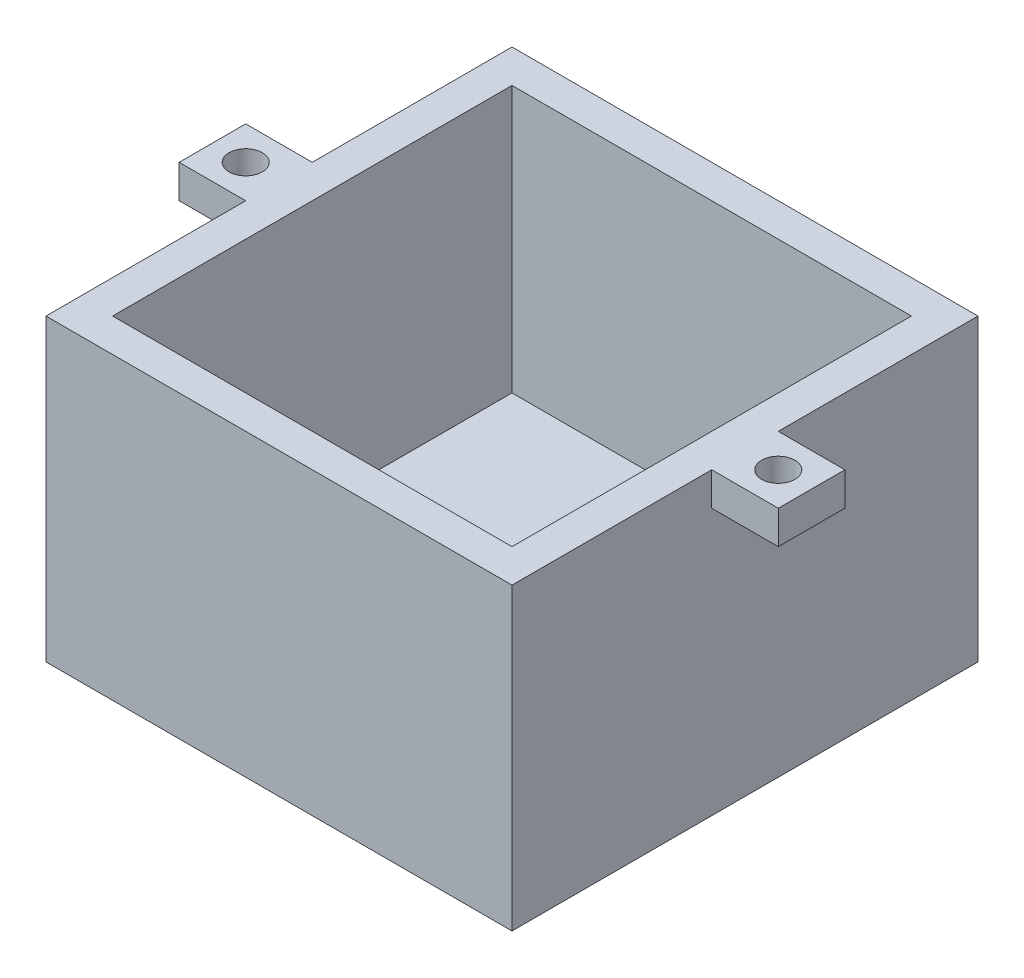
ISO-10303-21;
HEADER;
FILE_DESCRIPTION(('STEP AP214'),'2;1');
FILE_NAME('part.step','',(''),(''),'','','');
FILE_SCHEMA(('AUTOMOTIVE_DESIGN { 1 0 10303 214 1 1 1 1 }'));
ENDSEC;
DATA;
#1=APPLICATION_CONTEXT('core data for automotive mechanical design processes');
#2=APPLICATION_PROTOCOL_DEFINITION('international standard','automotive_design',2000,#1);
#3=PRODUCT_CONTEXT('',#1,'mechanical');
#4=PRODUCT('Part','Part','',(#3));
#5=PRODUCT_RELATED_PRODUCT_CATEGORY('part','',(#4));
#6=PRODUCT_DEFINITION_FORMATION('','',#4);
#7=PRODUCT_DEFINITION_CONTEXT('part definition',#1,'design');
#8=PRODUCT_DEFINITION('design','',#6,#7);
#9=PRODUCT_DEFINITION_SHAPE('','',#8);
#10=(LENGTH_UNIT() NAMED_UNIT(*) SI_UNIT(.MILLI.,.METRE.));
#11=(NAMED_UNIT(*) PLANE_ANGLE_UNIT() SI_UNIT($,.RADIAN.));
#12=(NAMED_UNIT(*) SI_UNIT($,.STERADIAN.) SOLID_ANGLE_UNIT());
#13=UNCERTAINTY_MEASURE_WITH_UNIT(LENGTH_MEASURE(1.E-05),#10,'distance_accuracy_value','');
#14=(GEOMETRIC_REPRESENTATION_CONTEXT(3) GLOBAL_UNCERTAINTY_ASSIGNED_CONTEXT((#13)) GLOBAL_UNIT_ASSIGNED_CONTEXT((#10,
#11,#12)) REPRESENTATION_CONTEXT('',''));
#15=CARTESIAN_POINT('',(0.,0.,0.));
#16=DIRECTION('',(0.,0.,1.));
#17=DIRECTION('',(1.,0.,0.));
#18=AXIS2_PLACEMENT_3D('',#15,#16,#17);
#19=CARTESIAN_POINT('',(-6.35,50.8,6.35));
#20=DIRECTION('',(1.,0.,0.));
#21=DIRECTION('',(0.,0.,-1.));
#22=AXIS2_PLACEMENT_3D('',#19,#20,#21);
#23=PLANE('',#22);
#24=DIRECTION('',(0.,1.,0.));
#25=VECTOR('',#24,1.);
#26=CARTESIAN_POINT('',(-6.35000000000001,44.45,-31.75));
#27=LINE('',#26,#25);
#28=CARTESIAN_POINT('',(-6.35000000000001,44.45,-31.75));
#29=VERTEX_POINT('',#28);
#30=CARTESIAN_POINT('',(-6.35000000000001,50.8,-31.75));
#31=VERTEX_POINT('',#30);
#32=EDGE_CURVE('E181',#29,#31,#27,.T.);
#33=ORIENTED_EDGE('',*,*,#32,.F.);
#34=DIRECTION('',(0.,0.,-1.));
#35=VECTOR('',#34,1.);
#36=CARTESIAN_POINT('',(-6.35000000000001,44.45,-44.45));
#37=LINE('',#36,#35);
#38=CARTESIAN_POINT('',(-6.35000000000001,44.45,-44.45));
#39=VERTEX_POINT('',#38);
#40=EDGE_CURVE('E154',#29,#39,#37,.T.);
#41=ORIENTED_EDGE('',*,*,#40,.T.);
#42=DIRECTION('',(0.,1.,0.));
#43=VECTOR('',#42,1.);
#44=CARTESIAN_POINT('',(-6.35000000000001,44.45,-44.45));
#45=LINE('',#44,#43);
#46=CARTESIAN_POINT('',(-6.35,50.8,-44.45));
#47=VERTEX_POINT('',#46);
#48=EDGE_CURVE('E166',#39,#47,#45,.T.);
#49=ORIENTED_EDGE('',*,*,#48,.T.);
#50=DIRECTION('',(0.,0.,1.));
#51=VECTOR('',#50,1.);
#52=CARTESIAN_POINT('',(-6.35,50.8,6.35));
#53=LINE('',#52,#51);
#54=CARTESIAN_POINT('',(-6.35,50.8,-82.55));
#55=VERTEX_POINT('',#54);
#56=EDGE_CURVE('E254',#55,#47,#53,.T.);
#57=ORIENTED_EDGE('',*,*,#56,.F.);
#58=DIRECTION('',(0.,-1.,0.));
#59=VECTOR('',#58,1.);
#60=CARTESIAN_POINT('',(-6.35,50.8,-82.55));
#61=LINE('',#60,#59);
#62=CARTESIAN_POINT('',(-6.35,-6.35,-82.55));
#63=VERTEX_POINT('',#62);
#64=EDGE_CURVE('E265',#55,#63,#61,.T.);
#65=ORIENTED_EDGE('',*,*,#64,.T.);
#66=DIRECTION('',(0.,0.,-1.));
#67=VECTOR('',#66,1.);
#68=CARTESIAN_POINT('',(-6.35,-6.35,-82.55));
#69=LINE('',#68,#67);
#70=CARTESIAN_POINT('',(-6.35,-6.35,6.35));
#71=VERTEX_POINT('',#70);
#72=EDGE_CURVE('E206',#71,#63,#69,.T.);
#73=ORIENTED_EDGE('',*,*,#72,.F.);
#74=DIRECTION('',(0.,-1.,0.));
#75=VECTOR('',#74,1.);
#76=CARTESIAN_POINT('',(-6.35,50.8,6.35));
#77=LINE('',#76,#75);
#78=CARTESIAN_POINT('',(-6.35,50.8,6.35));
#79=VERTEX_POINT('',#78);
#80=EDGE_CURVE('E11',#79,#71,#77,.T.);
#81=ORIENTED_EDGE('',*,*,#80,.F.);
#82=EDGE_CURVE('E253',#31,#79,#53,.T.);
#83=ORIENTED_EDGE('',*,*,#82,.F.);
#84=EDGE_LOOP('',(#33,#41,#49,#57,#65,#73,#81,#83));
#85=FACE_BOUND('',#84,.T.);
#86=ADVANCED_FACE('F33',(#85),#23,.F.);
#87=CARTESIAN_POINT('',(82.55,50.8,6.35));
#88=DIRECTION('',(-1.,0.,0.));
#89=DIRECTION('',(0.,0.,1.));
#90=AXIS2_PLACEMENT_3D('',#87,#88,#89);
#91=PLANE('',#90);
#92=DIRECTION('',(0.,1.,0.));
#93=VECTOR('',#92,1.);
#94=CARTESIAN_POINT('',(82.55,44.45,-44.45));
#95=LINE('',#94,#93);
#96=CARTESIAN_POINT('',(82.55,44.45,-44.45));
#97=VERTEX_POINT('',#96);
#98=CARTESIAN_POINT('',(82.55,50.8,-44.45));
#99=VERTEX_POINT('',#98);
#100=EDGE_CURVE('E204',#97,#99,#95,.T.);
#101=ORIENTED_EDGE('',*,*,#100,.F.);
#102=DIRECTION('',(0.,0.,1.));
#103=VECTOR('',#102,1.);
#104=CARTESIAN_POINT('',(82.55,44.45,-44.45));
#105=LINE('',#104,#103);
#106=CARTESIAN_POINT('',(82.55,44.45,-31.75));
#107=VERTEX_POINT('',#106);
#108=EDGE_CURVE('E184',#97,#107,#105,.T.);
#109=ORIENTED_EDGE('',*,*,#108,.T.);
#110=DIRECTION('',(0.,1.,0.));
#111=VECTOR('',#110,1.);
#112=CARTESIAN_POINT('',(82.55,44.45,-31.75));
#113=LINE('',#112,#111);
#114=CARTESIAN_POINT('',(82.55,50.8,-31.75));
#115=VERTEX_POINT('',#114);
#116=EDGE_CURVE('E197',#107,#115,#113,.T.);
#117=ORIENTED_EDGE('',*,*,#116,.T.);
#118=DIRECTION('',(0.,0.,-1.));
#119=VECTOR('',#118,1.);
#120=CARTESIAN_POINT('',(82.55,50.8,6.35));
#121=LINE('',#120,#119);
#122=CARTESIAN_POINT('',(82.55,50.8,6.35));
#123=VERTEX_POINT('',#122);
#124=EDGE_CURVE('E260',#123,#115,#121,.T.);
#125=ORIENTED_EDGE('',*,*,#124,.F.);
#126=DIRECTION('',(0.,-1.,0.));
#127=VECTOR('',#126,1.);
#128=CARTESIAN_POINT('',(82.55,50.8,6.35));
#129=LINE('',#128,#127);
#130=CARTESIAN_POINT('',(82.55,-6.35,6.35));
#131=VERTEX_POINT('',#130);
#132=EDGE_CURVE('E41',#123,#131,#129,.T.);
#133=ORIENTED_EDGE('',*,*,#132,.T.);
#134=DIRECTION('',(0.,0.,1.));
#135=VECTOR('',#134,1.);
#136=CARTESIAN_POINT('',(82.55,-6.35,-82.55));
#137=LINE('',#136,#135);
#138=CARTESIAN_POINT('',(82.55,-6.35,-82.55));
#139=VERTEX_POINT('',#138);
#140=EDGE_CURVE('E217',#139,#131,#137,.T.);
#141=ORIENTED_EDGE('',*,*,#140,.F.);
#142=DIRECTION('',(0.,-1.,0.));
#143=VECTOR('',#142,1.);
#144=CARTESIAN_POINT('',(82.55,50.8,-82.55));
#145=LINE('',#144,#143);
#146=CARTESIAN_POINT('',(82.55,50.8,-82.55));
#147=VERTEX_POINT('',#146);
#148=EDGE_CURVE('E267',#147,#139,#145,.T.);
#149=ORIENTED_EDGE('',*,*,#148,.F.);
#150=EDGE_CURVE('E259',#99,#147,#121,.T.);
#151=ORIENTED_EDGE('',*,*,#150,.F.);
#152=EDGE_LOOP('',(#101,#109,#117,#125,#133,#141,#149,#151));
#153=FACE_BOUND('',#152,.T.);
#154=ADVANCED_FACE('F289',(#153),#91,.F.);
#155=CARTESIAN_POINT('',(0.,50.8,0.));
#156=DIRECTION('',(0.,-1.,0.));
#157=DIRECTION('',(0.,0.,-1.));
#158=AXIS2_PLACEMENT_3D('',#155,#156,#157);
#159=PLANE('',#158);
#160=CARTESIAN_POINT('',(-12.7,50.8,-38.1));
#161=DIRECTION('',(0.,1.,0.));
#162=DIRECTION('',(0.,0.,-1.));
#163=AXIS2_PLACEMENT_3D('',#160,#161,#162);
#164=CIRCLE('',#163,3.175);
#165=CARTESIAN_POINT('',(-12.7,50.8,-41.275));
#166=VERTEX_POINT('',#165);
#167=EDGE_CURVE('E276',#166,#166,#164,.T.);
#168=ORIENTED_EDGE('',*,*,#167,.F.);
#169=EDGE_LOOP('',(#168));
#170=FACE_BOUND('',#169,.T.);
#171=CARTESIAN_POINT('',(88.9,50.8,-38.1));
#172=DIRECTION('',(0.,1.,0.));
#173=DIRECTION('',(0.,0.,1.));
#174=AXIS2_PLACEMENT_3D('',#171,#172,#173);
#175=CIRCLE('',#174,3.175);
#176=CARTESIAN_POINT('',(88.9,50.8,-34.925));
#177=VERTEX_POINT('',#176);
#178=EDGE_CURVE('E172',#177,#177,#175,.T.);
#179=ORIENTED_EDGE('',*,*,#178,.F.);
#180=EDGE_LOOP('',(#179));
#181=FACE_BOUND('',#180,.T.);
#182=ORIENTED_EDGE('',*,*,#56,.T.);
#183=DIRECTION('',(-1.,0.,0.));
#184=VECTOR('',#183,1.);
#185=CARTESIAN_POINT('',(-6.35000000000001,50.8,-44.45));
#186=LINE('',#185,#184);
#187=CARTESIAN_POINT('',(-19.05,50.8,-44.45));
#188=VERTEX_POINT('',#187);
#189=EDGE_CURVE('E49',#47,#188,#186,.T.);
#190=ORIENTED_EDGE('',*,*,#189,.T.);
#191=DIRECTION('',(0.,0.,1.));
#192=VECTOR('',#191,1.);
#193=CARTESIAN_POINT('',(-19.05,50.8,-44.45));
#194=LINE('',#193,#192);
#195=CARTESIAN_POINT('',(-19.05,50.8,-31.75));
#196=VERTEX_POINT('',#195);
#197=EDGE_CURVE('E151',#188,#196,#194,.T.);
#198=ORIENTED_EDGE('',*,*,#197,.T.);
#199=DIRECTION('',(1.,0.,0.));
#200=VECTOR('',#199,1.);
#201=CARTESIAN_POINT('',(-6.35000000000001,50.8,-31.75));
#202=LINE('',#201,#200);
#203=EDGE_CURVE('E167',#196,#31,#202,.T.);
#204=ORIENTED_EDGE('',*,*,#203,.T.);
#205=ORIENTED_EDGE('',*,*,#82,.T.);
#206=DIRECTION('',(1.,0.,0.));
#207=VECTOR('',#206,1.);
#208=CARTESIAN_POINT('',(-6.35,50.8,6.35));
#209=LINE('',#208,#207);
#210=EDGE_CURVE('E257',#79,#123,#209,.T.);
#211=ORIENTED_EDGE('',*,*,#210,.T.);
#212=ORIENTED_EDGE('',*,*,#124,.T.);
#213=DIRECTION('',(1.,0.,0.));
#214=VECTOR('',#213,1.);
#215=CARTESIAN_POINT('',(82.55,50.8,-31.75));
#216=LINE('',#215,#214);
#217=CARTESIAN_POINT('',(95.25,50.8,-31.75));
#218=VERTEX_POINT('',#217);
#219=EDGE_CURVE('E57',#115,#218,#216,.T.);
#220=ORIENTED_EDGE('',*,*,#219,.T.);
#221=DIRECTION('',(0.,0.,-1.));
#222=VECTOR('',#221,1.);
#223=CARTESIAN_POINT('',(95.25,50.8,-44.45));
#224=LINE('',#223,#222);
#225=CARTESIAN_POINT('',(95.25,50.8,-44.45));
#226=VERTEX_POINT('',#225);
#227=EDGE_CURVE('E199',#218,#226,#224,.T.);
#228=ORIENTED_EDGE('',*,*,#227,.T.);
#229=DIRECTION('',(-1.,0.,0.));
#230=VECTOR('',#229,1.);
#231=CARTESIAN_POINT('',(82.55,50.8,-44.45));
#232=LINE('',#231,#230);
#233=EDGE_CURVE('E188',#226,#99,#232,.T.);
#234=ORIENTED_EDGE('',*,*,#233,.T.);
#235=ORIENTED_EDGE('',*,*,#150,.T.);
#236=DIRECTION('',(-1.,0.,0.));
#237=VECTOR('',#236,1.);
#238=CARTESIAN_POINT('',(-6.35,50.8,-82.55));
#239=LINE('',#238,#237);
#240=EDGE_CURVE('E263',#147,#55,#239,.T.);
#241=ORIENTED_EDGE('',*,*,#240,.T.);
#242=EDGE_LOOP('',(#182,#190,#198,#204,#205,#211,#212,#220,#228,#234,#235,#241));
#243=FACE_BOUND('',#242,.T.);
#244=DIRECTION('',(0.,0.,1.));
#245=VECTOR('',#244,1.);
#246=CARTESIAN_POINT('',(0.,50.8,0.));
#247=LINE('',#246,#245);
#248=CARTESIAN_POINT('',(0.,50.8,-76.2));
#249=VERTEX_POINT('',#248);
#250=CARTESIAN_POINT('',(0.,50.8,0.));
#251=VERTEX_POINT('',#250);
#252=EDGE_CURVE('E224',#249,#251,#247,.T.);
#253=ORIENTED_EDGE('',*,*,#252,.F.);
#254=DIRECTION('',(-1.,0.,0.));
#255=VECTOR('',#254,1.);
#256=CARTESIAN_POINT('',(0.,50.8,-76.2));
#257=LINE('',#256,#255);
#258=CARTESIAN_POINT('',(76.2,50.8,-76.2));
#259=VERTEX_POINT('',#258);
#260=EDGE_CURVE('E232',#259,#249,#257,.T.);
#261=ORIENTED_EDGE('',*,*,#260,.F.);
#262=DIRECTION('',(0.,0.,-1.));
#263=VECTOR('',#262,1.);
#264=CARTESIAN_POINT('',(76.2,50.8,0.));
#265=LINE('',#264,#263);
#266=CARTESIAN_POINT('',(76.2,50.8,0.));
#267=VERTEX_POINT('',#266);
#268=EDGE_CURVE('E229',#267,#259,#265,.T.);
#269=ORIENTED_EDGE('',*,*,#268,.F.);
#270=DIRECTION('',(1.,0.,0.));
#271=VECTOR('',#270,1.);
#272=CARTESIAN_POINT('',(0.,50.8,0.));
#273=LINE('',#272,#271);
#274=EDGE_CURVE('E226',#251,#267,#273,.T.);
#275=ORIENTED_EDGE('',*,*,#274,.F.);
#276=EDGE_LOOP('',(#253,#261,#269,#275));
#277=FACE_BOUND('',#276,.T.);
#278=ADVANCED_FACE('F285',(#170,#181,#243,#277),#159,.F.);
#279=CARTESIAN_POINT('',(-6.35,50.8,6.35));
#280=DIRECTION('',(0.,0.,-1.));
#281=DIRECTION('',(-1.,0.,0.));
#282=AXIS2_PLACEMENT_3D('',#279,#280,#281);
#283=PLANE('',#282);
#284=ORIENTED_EDGE('',*,*,#80,.T.);
#285=DIRECTION('',(-1.,0.,0.));
#286=VECTOR('',#285,1.);
#287=CARTESIAN_POINT('',(-6.35,-6.35,6.35));
#288=LINE('',#287,#286);
#289=EDGE_CURVE('E220',#131,#71,#288,.T.);
#290=ORIENTED_EDGE('',*,*,#289,.F.);
#291=ORIENTED_EDGE('',*,*,#132,.F.);
#292=ORIENTED_EDGE('',*,*,#210,.F.);
#293=EDGE_LOOP('',(#284,#290,#291,#292));
#294=FACE_BOUND('',#293,.T.);
#295=ADVANCED_FACE('F288',(#294),#283,.F.);
#296=CARTESIAN_POINT('',(-6.35,50.8,-82.55));
#297=DIRECTION('',(0.,0.,1.));
#298=DIRECTION('',(1.,0.,0.));
#299=AXIS2_PLACEMENT_3D('',#296,#297,#298);
#300=PLANE('',#299);
#301=ORIENTED_EDGE('',*,*,#148,.T.);
#302=DIRECTION('',(1.,0.,0.));
#303=VECTOR('',#302,1.);
#304=CARTESIAN_POINT('',(-6.35,-6.35,-82.55));
#305=LINE('',#304,#303);
#306=EDGE_CURVE('E214',#63,#139,#305,.T.);
#307=ORIENTED_EDGE('',*,*,#306,.F.);
#308=ORIENTED_EDGE('',*,*,#64,.F.);
#309=ORIENTED_EDGE('',*,*,#240,.F.);
#310=EDGE_LOOP('',(#301,#307,#308,#309));
#311=FACE_BOUND('',#310,.T.);
#312=ADVANCED_FACE('F357',(#311),#300,.F.);
#313=CARTESIAN_POINT('',(0.,50.8,0.));
#314=DIRECTION('',(1.,0.,0.));
#315=DIRECTION('',(0.,0.,-1.));
#316=AXIS2_PLACEMENT_3D('',#313,#314,#315);
#317=PLANE('',#316);
#318=DIRECTION('',(0.,0.,1.));
#319=VECTOR('',#318,1.);
#320=CARTESIAN_POINT('',(0.,0.,0.));
#321=LINE('',#320,#319);
#322=CARTESIAN_POINT('',(0.,0.,-76.2));
#323=VERTEX_POINT('',#322);
#324=CARTESIAN_POINT('',(0.,0.,0.));
#325=VERTEX_POINT('',#324);
#326=EDGE_CURVE('E223',#323,#325,#321,.T.);
#327=ORIENTED_EDGE('',*,*,#326,.F.);
#328=DIRECTION('',(0.,-1.,0.));
#329=VECTOR('',#328,1.);
#330=CARTESIAN_POINT('',(0.,50.8,-76.2));
#331=LINE('',#330,#329);
#332=EDGE_CURVE('E234',#249,#323,#331,.T.);
#333=ORIENTED_EDGE('',*,*,#332,.F.);
#334=ORIENTED_EDGE('',*,*,#252,.T.);
#335=DIRECTION('',(0.,-1.,0.));
#336=VECTOR('',#335,1.);
#337=CARTESIAN_POINT('',(0.,50.8,0.));
#338=LINE('',#337,#336);
#339=EDGE_CURVE('E250',#251,#325,#338,.T.);
#340=ORIENTED_EDGE('',*,*,#339,.T.);
#341=EDGE_LOOP('',(#327,#333,#334,#340));
#342=FACE_BOUND('',#341,.T.);
#343=ADVANCED_FACE('F302',(#342),#317,.T.);
#344=CARTESIAN_POINT('',(0.,50.8,0.));
#345=DIRECTION('',(0.,0.,-1.));
#346=DIRECTION('',(-1.,0.,0.));
#347=AXIS2_PLACEMENT_3D('',#344,#345,#346);
#348=PLANE('',#347);
#349=DIRECTION('',(1.,0.,0.));
#350=VECTOR('',#349,1.);
#351=CARTESIAN_POINT('',(0.,0.,0.));
#352=LINE('',#351,#350);
#353=CARTESIAN_POINT('',(76.2,0.,0.));
#354=VERTEX_POINT('',#353);
#355=EDGE_CURVE('E237',#325,#354,#352,.T.);
#356=ORIENTED_EDGE('',*,*,#355,.F.);
#357=ORIENTED_EDGE('',*,*,#339,.F.);
#358=ORIENTED_EDGE('',*,*,#274,.T.);
#359=DIRECTION('',(0.,-1.,0.));
#360=VECTOR('',#359,1.);
#361=CARTESIAN_POINT('',(76.2,50.8,0.));
#362=LINE('',#361,#360);
#363=EDGE_CURVE('E248',#267,#354,#362,.T.);
#364=ORIENTED_EDGE('',*,*,#363,.T.);
#365=EDGE_LOOP('',(#356,#357,#358,#364));
#366=FACE_BOUND('',#365,.T.);
#367=ADVANCED_FACE('F304',(#366),#348,.T.);
#368=CARTESIAN_POINT('',(76.2,50.8,0.));
#369=DIRECTION('',(-1.,0.,0.));
#370=DIRECTION('',(0.,0.,1.));
#371=AXIS2_PLACEMENT_3D('',#368,#369,#370);
#372=PLANE('',#371);
#373=DIRECTION('',(0.,0.,-1.));
#374=VECTOR('',#373,1.);
#375=CARTESIAN_POINT('',(76.2,0.,0.));
#376=LINE('',#375,#374);
#377=CARTESIAN_POINT('',(76.2,0.,-76.2));
#378=VERTEX_POINT('',#377);
#379=EDGE_CURVE('E240',#354,#378,#376,.T.);
#380=ORIENTED_EDGE('',*,*,#379,.F.);
#381=ORIENTED_EDGE('',*,*,#363,.F.);
#382=ORIENTED_EDGE('',*,*,#268,.T.);
#383=DIRECTION('',(0.,-1.,0.));
#384=VECTOR('',#383,1.);
#385=CARTESIAN_POINT('',(76.2,50.8,-76.2));
#386=LINE('',#385,#384);
#387=EDGE_CURVE('E246',#259,#378,#386,.T.);
#388=ORIENTED_EDGE('',*,*,#387,.T.);
#389=EDGE_LOOP('',(#380,#381,#382,#388));
#390=FACE_BOUND('',#389,.T.);
#391=ADVANCED_FACE('F313',(#390),#372,.T.);
#392=CARTESIAN_POINT('',(0.,50.8,-76.2));
#393=DIRECTION('',(0.,0.,1.));
#394=DIRECTION('',(1.,0.,0.));
#395=AXIS2_PLACEMENT_3D('',#392,#393,#394);
#396=PLANE('',#395);
#397=DIRECTION('',(-1.,0.,0.));
#398=VECTOR('',#397,1.);
#399=CARTESIAN_POINT('',(0.,0.,-76.2));
#400=LINE('',#399,#398);
#401=EDGE_CURVE('E227',#378,#323,#400,.T.);
#402=ORIENTED_EDGE('',*,*,#401,.F.);
#403=ORIENTED_EDGE('',*,*,#387,.F.);
#404=ORIENTED_EDGE('',*,*,#260,.T.);
#405=ORIENTED_EDGE('',*,*,#332,.T.);
#406=EDGE_LOOP('',(#402,#403,#404,#405));
#407=FACE_BOUND('',#406,.T.);
#408=ADVANCED_FACE('F311',(#407),#396,.T.);
#409=CARTESIAN_POINT('',(0.,0.,0.));
#410=DIRECTION('',(0.,1.,0.));
#411=DIRECTION('',(0.,0.,1.));
#412=AXIS2_PLACEMENT_3D('',#409,#410,#411);
#413=PLANE('',#412);
#414=ORIENTED_EDGE('',*,*,#401,.T.);
#415=ORIENTED_EDGE('',*,*,#326,.T.);
#416=ORIENTED_EDGE('',*,*,#355,.T.);
#417=ORIENTED_EDGE('',*,*,#379,.T.);
#418=EDGE_LOOP('',(#414,#415,#416,#417));
#419=FACE_BOUND('',#418,.T.);
#420=ADVANCED_FACE('F308',(#419),#413,.T.);
#421=CARTESIAN_POINT('',(0.,-6.35,0.));
#422=DIRECTION('',(0.,1.,0.));
#423=DIRECTION('',(0.,0.,1.));
#424=AXIS2_PLACEMENT_3D('',#421,#422,#423);
#425=PLANE('',#424);
#426=ORIENTED_EDGE('',*,*,#72,.T.);
#427=ORIENTED_EDGE('',*,*,#306,.T.);
#428=ORIENTED_EDGE('',*,*,#140,.T.);
#429=ORIENTED_EDGE('',*,*,#289,.T.);
#430=EDGE_LOOP('',(#426,#427,#428,#429));
#431=FACE_BOUND('',#430,.T.);
#432=ADVANCED_FACE('F344',(#431),#425,.F.);
#433=CARTESIAN_POINT('',(82.55,44.45,-44.45));
#434=DIRECTION('',(0.,0.,-1.));
#435=DIRECTION('',(-1.,0.,0.));
#436=AXIS2_PLACEMENT_3D('',#433,#434,#435);
#437=PLANE('',#436);
#438=ORIENTED_EDGE('',*,*,#233,.F.);
#439=DIRECTION('',(0.,1.,0.));
#440=VECTOR('',#439,1.);
#441=CARTESIAN_POINT('',(95.25,44.45,-44.45));
#442=LINE('',#441,#440);
#443=CARTESIAN_POINT('',(95.25,44.45,-44.45));
#444=VERTEX_POINT('',#443);
#445=EDGE_CURVE('E207',#444,#226,#442,.T.);
#446=ORIENTED_EDGE('',*,*,#445,.F.);
#447=DIRECTION('',(-1.,0.,0.));
#448=VECTOR('',#447,1.);
#449=CARTESIAN_POINT('',(82.55,44.45,-44.45));
#450=LINE('',#449,#448);
#451=EDGE_CURVE('E194',#444,#97,#450,.T.);
#452=ORIENTED_EDGE('',*,*,#451,.T.);
#453=ORIENTED_EDGE('',*,*,#100,.T.);
#454=EDGE_LOOP('',(#438,#446,#452,#453));
#455=FACE_BOUND('',#454,.T.);
#456=ADVANCED_FACE('F354',(#455),#437,.T.);
#457=CARTESIAN_POINT('',(95.25,44.45,-44.45));
#458=DIRECTION('',(1.,0.,0.));
#459=DIRECTION('',(0.,0.,-1.));
#460=AXIS2_PLACEMENT_3D('',#457,#458,#459);
#461=PLANE('',#460);
#462=ORIENTED_EDGE('',*,*,#227,.F.);
#463=DIRECTION('',(0.,1.,0.));
#464=VECTOR('',#463,1.);
#465=CARTESIAN_POINT('',(95.25,44.45,-31.75));
#466=LINE('',#465,#464);
#467=CARTESIAN_POINT('',(95.25,44.45,-31.75));
#468=VERTEX_POINT('',#467);
#469=EDGE_CURVE('E209',#468,#218,#466,.T.);
#470=ORIENTED_EDGE('',*,*,#469,.F.);
#471=DIRECTION('',(0.,0.,-1.));
#472=VECTOR('',#471,1.);
#473=CARTESIAN_POINT('',(95.25,44.45,-44.45));
#474=LINE('',#473,#472);
#475=EDGE_CURVE('E191',#468,#444,#474,.T.);
#476=ORIENTED_EDGE('',*,*,#475,.T.);
#477=ORIENTED_EDGE('',*,*,#445,.T.);
#478=EDGE_LOOP('',(#462,#470,#476,#477));
#479=FACE_BOUND('',#478,.T.);
#480=ADVANCED_FACE('F391',(#479),#461,.T.);
#481=CARTESIAN_POINT('',(82.55,44.45,-31.75));
#482=DIRECTION('',(0.,0.,1.));
#483=DIRECTION('',(1.,0.,0.));
#484=AXIS2_PLACEMENT_3D('',#481,#482,#483);
#485=PLANE('',#484);
#486=ORIENTED_EDGE('',*,*,#219,.F.);
#487=ORIENTED_EDGE('',*,*,#116,.F.);
#488=DIRECTION('',(1.,0.,0.));
#489=VECTOR('',#488,1.);
#490=CARTESIAN_POINT('',(82.55,44.45,-31.75));
#491=LINE('',#490,#489);
#492=EDGE_CURVE('E187',#107,#468,#491,.T.);
#493=ORIENTED_EDGE('',*,*,#492,.T.);
#494=ORIENTED_EDGE('',*,*,#469,.T.);
#495=EDGE_LOOP('',(#486,#487,#493,#494));
#496=FACE_BOUND('',#495,.T.);
#497=ADVANCED_FACE('F401',(#496),#485,.T.);
#498=CARTESIAN_POINT('',(0.,44.45,0.));
#499=DIRECTION('',(0.,1.,0.));
#500=DIRECTION('',(0.,0.,1.));
#501=AXIS2_PLACEMENT_3D('',#498,#499,#500);
#502=PLANE('',#501);
#503=CARTESIAN_POINT('',(88.9,44.45,-38.1));
#504=DIRECTION('',(0.,1.,0.));
#505=DIRECTION('',(0.,0.,1.));
#506=AXIS2_PLACEMENT_3D('',#503,#504,#505);
#507=CIRCLE('',#506,3.175);
#508=CARTESIAN_POINT('',(88.9,44.45,-34.925));
#509=VERTEX_POINT('',#508);
#510=EDGE_CURVE('E178',#509,#509,#507,.T.);
#511=ORIENTED_EDGE('',*,*,#510,.T.);
#512=EDGE_LOOP('',(#511));
#513=FACE_BOUND('',#512,.T.);
#514=ORIENTED_EDGE('',*,*,#108,.F.);
#515=ORIENTED_EDGE('',*,*,#451,.F.);
#516=ORIENTED_EDGE('',*,*,#475,.F.);
#517=ORIENTED_EDGE('',*,*,#492,.F.);
#518=EDGE_LOOP('',(#514,#515,#516,#517));
#519=FACE_BOUND('',#518,.T.);
#520=ADVANCED_FACE('F410',(#513,#519),#502,.F.);
#521=CARTESIAN_POINT('',(-6.35000000000001,44.45,-44.45));
#522=DIRECTION('',(0.,0.,-1.));
#523=DIRECTION('',(-1.,0.,0.));
#524=AXIS2_PLACEMENT_3D('',#521,#522,#523);
#525=PLANE('',#524);
#526=ORIENTED_EDGE('',*,*,#189,.F.);
#527=ORIENTED_EDGE('',*,*,#48,.F.);
#528=DIRECTION('',(-1.,0.,0.));
#529=VECTOR('',#528,1.);
#530=CARTESIAN_POINT('',(-6.35000000000001,44.45,-44.45));
#531=LINE('',#530,#529);
#532=CARTESIAN_POINT('',(-19.05,44.45,-44.45));
#533=VERTEX_POINT('',#532);
#534=EDGE_CURVE('E161',#39,#533,#531,.T.);
#535=ORIENTED_EDGE('',*,*,#534,.T.);
#536=DIRECTION('',(0.,1.,0.));
#537=VECTOR('',#536,1.);
#538=CARTESIAN_POINT('',(-19.05,44.45,-44.45));
#539=LINE('',#538,#537);
#540=EDGE_CURVE('E146',#533,#188,#539,.T.);
#541=ORIENTED_EDGE('',*,*,#540,.T.);
#542=EDGE_LOOP('',(#526,#527,#535,#541));
#543=FACE_BOUND('',#542,.T.);
#544=ADVANCED_FACE('F165',(#543),#525,.T.);
#545=CARTESIAN_POINT('',(-6.35000000000001,44.45,-31.75));
#546=DIRECTION('',(0.,0.,1.));
#547=DIRECTION('',(1.,0.,0.));
#548=AXIS2_PLACEMENT_3D('',#545,#546,#547);
#549=PLANE('',#548);
#550=ORIENTED_EDGE('',*,*,#203,.F.);
#551=DIRECTION('',(0.,1.,0.));
#552=VECTOR('',#551,1.);
#553=CARTESIAN_POINT('',(-19.05,44.45,-31.75));
#554=LINE('',#553,#552);
#555=CARTESIAN_POINT('',(-19.05,44.45,-31.75));
#556=VERTEX_POINT('',#555);
#557=EDGE_CURVE('E153',#556,#196,#554,.T.);
#558=ORIENTED_EDGE('',*,*,#557,.F.);
#559=DIRECTION('',(1.,0.,0.));
#560=VECTOR('',#559,1.);
#561=CARTESIAN_POINT('',(-6.35000000000001,44.45,-31.75));
#562=LINE('',#561,#560);
#563=EDGE_CURVE('E163',#556,#29,#562,.T.);
#564=ORIENTED_EDGE('',*,*,#563,.T.);
#565=ORIENTED_EDGE('',*,*,#32,.T.);
#566=EDGE_LOOP('',(#550,#558,#564,#565));
#567=FACE_BOUND('',#566,.T.);
#568=ADVANCED_FACE('F334',(#567),#549,.T.);
#569=CARTESIAN_POINT('',(-19.05,44.45,-44.45));
#570=DIRECTION('',(-1.,0.,0.));
#571=DIRECTION('',(0.,0.,1.));
#572=AXIS2_PLACEMENT_3D('',#569,#570,#571);
#573=PLANE('',#572);
#574=ORIENTED_EDGE('',*,*,#197,.F.);
#575=ORIENTED_EDGE('',*,*,#540,.F.);
#576=DIRECTION('',(0.,0.,1.));
#577=VECTOR('',#576,1.);
#578=CARTESIAN_POINT('',(-19.05,44.45,-44.45));
#579=LINE('',#578,#577);
#580=EDGE_CURVE('E149',#533,#556,#579,.T.);
#581=ORIENTED_EDGE('',*,*,#580,.T.);
#582=ORIENTED_EDGE('',*,*,#557,.T.);
#583=EDGE_LOOP('',(#574,#575,#581,#582));
#584=FACE_BOUND('',#583,.T.);
#585=ADVANCED_FACE('F148',(#584),#573,.T.);
#586=CARTESIAN_POINT('',(0.,44.45,0.));
#587=DIRECTION('',(0.,1.,0.));
#588=DIRECTION('',(0.,0.,1.));
#589=AXIS2_PLACEMENT_3D('',#586,#587,#588);
#590=PLANE('',#589);
#591=CARTESIAN_POINT('',(-12.7,44.45,-38.1));
#592=DIRECTION('',(0.,1.,0.));
#593=DIRECTION('',(0.,0.,1.));
#594=AXIS2_PLACEMENT_3D('',#591,#592,#593);
#595=CIRCLE('',#594,3.175);
#596=CARTESIAN_POINT('',(-12.7,44.45,-34.925));
#597=VERTEX_POINT('',#596);
#598=EDGE_CURVE('E36',#597,#597,#595,.T.);
#599=ORIENTED_EDGE('',*,*,#598,.T.);
#600=EDGE_LOOP('',(#599));
#601=FACE_BOUND('',#600,.T.);
#602=ORIENTED_EDGE('',*,*,#534,.F.);
#603=ORIENTED_EDGE('',*,*,#40,.F.);
#604=ORIENTED_EDGE('',*,*,#563,.F.);
#605=ORIENTED_EDGE('',*,*,#580,.F.);
#606=EDGE_LOOP('',(#602,#603,#604,#605));
#607=FACE_BOUND('',#606,.T.);
#608=ADVANCED_FACE('F159',(#601,#607),#590,.F.);
#609=CARTESIAN_POINT('',(88.9,-6.35,-38.1));
#610=DIRECTION('',(0.,1.,0.));
#611=DIRECTION('',(0.,0.,1.));
#612=AXIS2_PLACEMENT_3D('',#609,#610,#611);
#613=CYLINDRICAL_SURFACE('',#612,3.175);
#614=ORIENTED_EDGE('',*,*,#178,.T.);
#615=EDGE_LOOP('',(#614));
#616=FACE_BOUND('',#615,.T.);
#617=ORIENTED_EDGE('',*,*,#510,.F.);
#618=EDGE_LOOP('',(#617));
#619=FACE_BOUND('',#618,.T.);
#620=ADVANCED_FACE('F444',(#616,#619),#613,.F.);
#621=CARTESIAN_POINT('',(-12.7,-6.35,-38.1));
#622=DIRECTION('',(0.,1.,0.));
#623=DIRECTION('',(0.,0.,1.));
#624=AXIS2_PLACEMENT_3D('',#621,#622,#623);
#625=CYLINDRICAL_SURFACE('',#624,3.175);
#626=ORIENTED_EDGE('',*,*,#167,.T.);
#627=EDGE_LOOP('',(#626));
#628=FACE_BOUND('',#627,.T.);
#629=ORIENTED_EDGE('',*,*,#598,.F.);
#630=EDGE_LOOP('',(#629));
#631=FACE_BOUND('',#630,.T.);
#632=ADVANCED_FACE('F282',(#628,#631),#625,.F.);
#633=CLOSED_SHELL('',(#86,#154,#278,#295,#312,#343,#367,#391,#408,#420,#432,#456,#480,#497,#520,
#544,#568,#585,#608,#620,#632));
#634=MANIFOLD_SOLID_BREP('B2',#633);
#635=ADVANCED_BREP_SHAPE_REPRESENTATION('',(#18,#634),#14);
#636=SHAPE_DEFINITION_REPRESENTATION(#9,#635);
ENDSEC;
END-ISO-10303-21;
